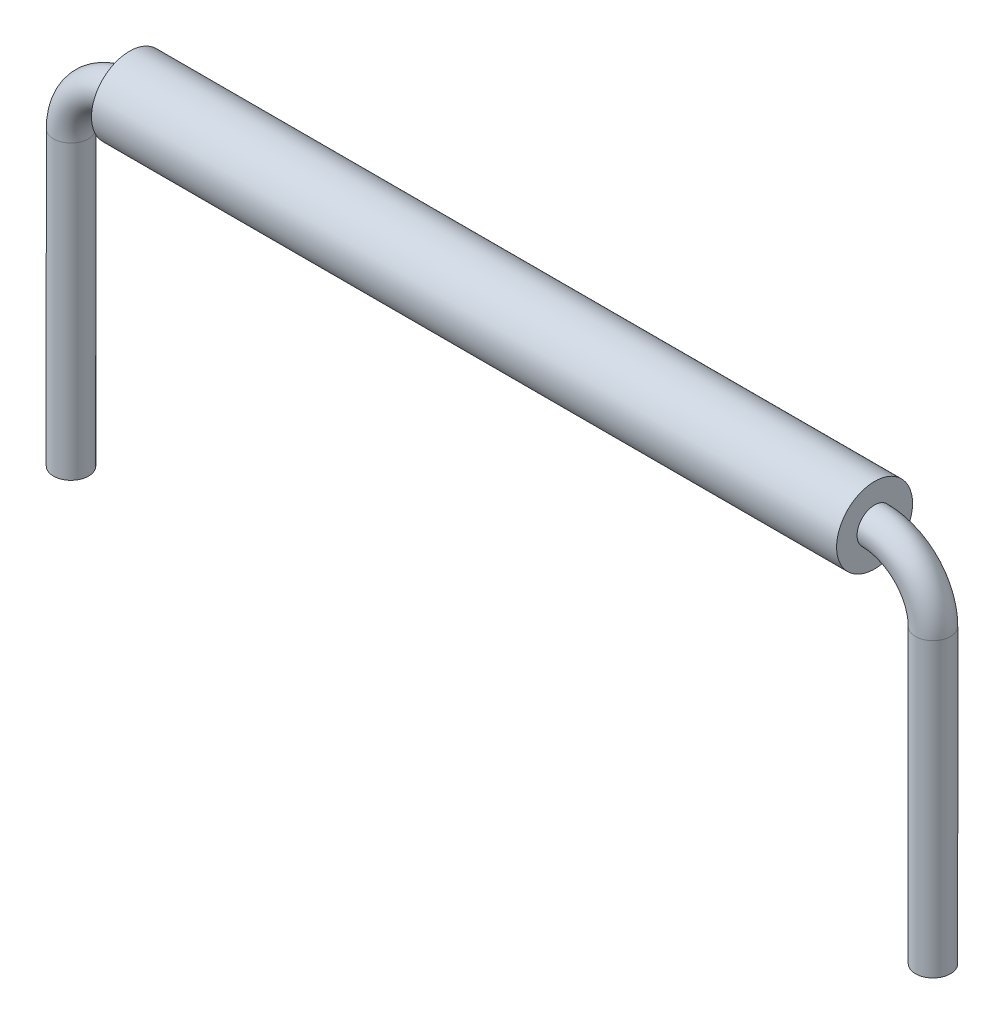
ISO-10303-21;
HEADER;
FILE_DESCRIPTION(('STEP AP214'),'2;1');
FILE_NAME('part.step','',(''),(''),'','','');
FILE_SCHEMA(('AUTOMOTIVE_DESIGN { 1 0 10303 214 1 1 1 1 }'));
ENDSEC;
DATA;
#1=APPLICATION_CONTEXT('core data for automotive mechanical design processes');
#2=APPLICATION_PROTOCOL_DEFINITION('international standard','automotive_design',2000,#1);
#3=PRODUCT_CONTEXT('',#1,'mechanical');
#4=PRODUCT('Part','Part','',(#3));
#5=PRODUCT_RELATED_PRODUCT_CATEGORY('part','',(#4));
#6=PRODUCT_DEFINITION_FORMATION('','',#4);
#7=PRODUCT_DEFINITION_CONTEXT('part definition',#1,'design');
#8=PRODUCT_DEFINITION('design','',#6,#7);
#9=PRODUCT_DEFINITION_SHAPE('','',#8);
#10=(LENGTH_UNIT() NAMED_UNIT(*) SI_UNIT(.MILLI.,.METRE.));
#11=(NAMED_UNIT(*) PLANE_ANGLE_UNIT() SI_UNIT($,.RADIAN.));
#12=(NAMED_UNIT(*) SI_UNIT($,.STERADIAN.) SOLID_ANGLE_UNIT());
#13=UNCERTAINTY_MEASURE_WITH_UNIT(LENGTH_MEASURE(1.E-05),#10,'distance_accuracy_value','');
#14=(GEOMETRIC_REPRESENTATION_CONTEXT(3) GLOBAL_UNCERTAINTY_ASSIGNED_CONTEXT((#13)) GLOBAL_UNIT_ASSIGNED_CONTEXT((#10,
#11,#12)) REPRESENTATION_CONTEXT('',''));
#15=CARTESIAN_POINT('',(0.,0.,0.));
#16=DIRECTION('',(0.,0.,1.));
#17=DIRECTION('',(1.,0.,0.));
#18=AXIS2_PLACEMENT_3D('',#15,#16,#17);
#19=CARTESIAN_POINT('',(6.3775,0.,0.));
#20=DIRECTION('',(1.,0.,0.));
#21=DIRECTION('',(0.,0.,-1.));
#22=AXIS2_PLACEMENT_3D('',#19,#20,#21);
#23=PLANE('',#22);
#24=CARTESIAN_POINT('',(6.3775,0.,0.));
#25=DIRECTION('',(1.,0.,0.));
#26=DIRECTION('',(0.,0.,-1.));
#27=AXIS2_PLACEMENT_3D('',#24,#25,#26);
#28=CIRCLE('',#27,0.65);
#29=CARTESIAN_POINT('',(6.3775,0.,-0.65));
#30=VERTEX_POINT('',#29);
#31=EDGE_CURVE('E11',#30,#30,#28,.T.);
#32=ORIENTED_EDGE('',*,*,#31,.T.);
#33=EDGE_LOOP('',(#32));
#34=FACE_BOUND('',#33,.T.);
#35=CARTESIAN_POINT('',(6.3775,0.,0.));
#36=DIRECTION('',(1.,0.,0.));
#37=DIRECTION('',(0.,0.,-1.));
#38=AXIS2_PLACEMENT_3D('',#35,#36,#37);
#39=CIRCLE('',#38,0.3);
#40=CARTESIAN_POINT('',(6.3775,0.,-0.3));
#41=VERTEX_POINT('',#40);
#42=EDGE_CURVE('E52',#41,#41,#39,.T.);
#43=ORIENTED_EDGE('',*,*,#42,.F.);
#44=EDGE_LOOP('',(#43));
#45=FACE_BOUND('',#44,.T.);
#46=ADVANCED_FACE('F45',(#34,#45),#23,.T.);
#47=CARTESIAN_POINT('',(6.3775,0.,0.));
#48=DIRECTION('',(-1.,0.,0.));
#49=DIRECTION('',(0.,0.,1.));
#50=AXIS2_PLACEMENT_3D('',#47,#48,#49);
#51=CYLINDRICAL_SURFACE('',#50,0.65);
#52=ORIENTED_EDGE('',*,*,#31,.F.);
#53=EDGE_LOOP('',(#52));
#54=FACE_BOUND('',#53,.T.);
#55=CARTESIAN_POINT('',(-6.3775,0.,0.));
#56=DIRECTION('',(1.,0.,0.));
#57=DIRECTION('',(0.,0.,-1.));
#58=AXIS2_PLACEMENT_3D('',#55,#56,#57);
#59=CIRCLE('',#58,0.65);
#60=CARTESIAN_POINT('',(-6.3775,0.,-0.65));
#61=VERTEX_POINT('',#60);
#62=EDGE_CURVE('E56',#61,#61,#59,.T.);
#63=ORIENTED_EDGE('',*,*,#62,.T.);
#64=EDGE_LOOP('',(#63));
#65=FACE_BOUND('',#64,.T.);
#66=ADVANCED_FACE('F47',(#54,#65),#51,.T.);
#67=CARTESIAN_POINT('',(6.3775,0.,0.));
#68=DIRECTION('',(-1.,0.,0.));
#69=DIRECTION('',(0.,0.,1.));
#70=AXIS2_PLACEMENT_3D('',#67,#68,#69);
#71=CYLINDRICAL_SURFACE('',#70,0.3);
#72=ORIENTED_EDGE('',*,*,#42,.T.);
#73=EDGE_LOOP('',(#72));
#74=FACE_BOUND('',#73,.T.);
#75=CARTESIAN_POINT('',(-6.3775,0.,0.));
#76=DIRECTION('',(1.,0.,0.));
#77=DIRECTION('',(0.,0.,-1.));
#78=AXIS2_PLACEMENT_3D('',#75,#76,#77);
#79=CIRCLE('',#78,0.3);
#80=CARTESIAN_POINT('',(-6.3775,0.,-0.3));
#81=VERTEX_POINT('',#80);
#82=EDGE_CURVE('E60',#81,#81,#79,.T.);
#83=ORIENTED_EDGE('',*,*,#82,.F.);
#84=EDGE_LOOP('',(#83));
#85=FACE_BOUND('',#84,.T.);
#86=ADVANCED_FACE('F69',(#74,#85),#71,.F.);
#87=CARTESIAN_POINT('',(-6.3775,0.,0.));
#88=DIRECTION('',(1.,0.,0.));
#89=DIRECTION('',(0.,0.,-1.));
#90=AXIS2_PLACEMENT_3D('',#87,#88,#89);
#91=PLANE('',#90);
#92=ORIENTED_EDGE('',*,*,#82,.T.);
#93=EDGE_LOOP('',(#92));
#94=FACE_BOUND('',#93,.T.);
#95=ORIENTED_EDGE('',*,*,#62,.F.);
#96=EDGE_LOOP('',(#95));
#97=FACE_BOUND('',#96,.T.);
#98=ADVANCED_FACE('F66',(#94,#97),#91,.F.);
#99=CLOSED_SHELL('',(#46,#66,#86,#98));
#100=MANIFOLD_SOLID_BREP('B2',#99);
#101=CARTESIAN_POINT('',(7.3775,-6.,0.));
#102=DIRECTION('',(0.,-1.,0.));
#103=DIRECTION('',(0.,0.,-1.));
#104=AXIS2_PLACEMENT_3D('',#101,#102,#103);
#105=PLANE('',#104);
#106=CARTESIAN_POINT('',(7.3775,-6.,0.));
#107=DIRECTION('',(0.,-1.,0.));
#108=DIRECTION('',(0.,0.,-1.));
#109=AXIS2_PLACEMENT_3D('',#106,#107,#108);
#110=CIRCLE('',#109,0.3);
#111=CARTESIAN_POINT('',(7.3775,-6.,-0.3));
#112=VERTEX_POINT('',#111);
#113=EDGE_CURVE('E129',#112,#112,#110,.T.);
#114=ORIENTED_EDGE('',*,*,#113,.T.);
#115=EDGE_LOOP('',(#114));
#116=FACE_BOUND('',#115,.T.);
#117=ADVANCED_FACE('F107',(#116),#105,.T.);
#118=CARTESIAN_POINT('',(-7.3775,-6.,0.));
#119=DIRECTION('',(0.,1.,0.));
#120=DIRECTION('',(0.,0.,-1.));
#121=AXIS2_PLACEMENT_3D('',#118,#119,#120);
#122=PLANE('',#121);
#123=CARTESIAN_POINT('',(-7.3775,-6.,0.));
#124=DIRECTION('',(0.,1.,0.));
#125=DIRECTION('',(0.,0.,-1.));
#126=AXIS2_PLACEMENT_3D('',#123,#124,#125);
#127=CIRCLE('',#126,0.3);
#128=CARTESIAN_POINT('',(-7.3775,-6.,-0.3));
#129=VERTEX_POINT('',#128);
#130=EDGE_CURVE('E44',#129,#129,#127,.T.);
#131=ORIENTED_EDGE('',*,*,#130,.F.);
#132=EDGE_LOOP('',(#131));
#133=FACE_BOUND('',#132,.T.);
#134=ADVANCED_FACE('F137',(#133),#122,.F.);
#135=CARTESIAN_POINT('',(7.3775,-6.,0.));
#136=DIRECTION('',(0.,1.,0.));
#137=DIRECTION('',(0.,0.,1.));
#138=AXIS2_PLACEMENT_3D('',#135,#136,#137);
#139=CYLINDRICAL_SURFACE('',#138,0.3);
#140=CARTESIAN_POINT('',(7.3775,-0.999999999999998,0.));
#141=DIRECTION('',(0.,-1.,0.));
#142=DIRECTION('',(0.,0.,-1.));
#143=AXIS2_PLACEMENT_3D('',#140,#141,#142);
#144=CIRCLE('',#143,0.3);
#145=CARTESIAN_POINT('',(7.6775,-0.999999999999998,0.));
#146=VERTEX_POINT('',#145);
#147=EDGE_CURVE('E126',#146,#146,#144,.T.);
#148=ORIENTED_EDGE('',*,*,#147,.T.);
#149=EDGE_LOOP('',(#148));
#150=FACE_BOUND('',#149,.T.);
#151=ORIENTED_EDGE('',*,*,#113,.F.);
#152=EDGE_LOOP('',(#151));
#153=FACE_BOUND('',#152,.T.);
#154=ADVANCED_FACE('F134',(#150,#153),#139,.T.);
#155=CARTESIAN_POINT('',(6.3775,-0.999999999999999,0.));
#156=DIRECTION('',(0.,0.,1.));
#157=DIRECTION('',(1.,0.,0.));
#158=AXIS2_PLACEMENT_3D('',#155,#156,#157);
#159=TOROIDAL_SURFACE('',#158,0.999999999999999,0.3);
#160=CARTESIAN_POINT('',(6.3775,0.,0.));
#161=DIRECTION('',(1.,0.,0.));
#162=DIRECTION('',(0.,0.,-1.));
#163=AXIS2_PLACEMENT_3D('',#160,#161,#162);
#164=CIRCLE('',#163,0.3);
#165=CARTESIAN_POINT('',(6.3775,0.300000000000001,0.));
#166=VERTEX_POINT('',#165);
#167=EDGE_CURVE('E121',#166,#166,#164,.T.);
#168=CARTESIAN_POINT('',(6.3775,-0.999999999999999,0.));
#169=DIRECTION('',(0.,0.,1.));
#170=DIRECTION('',(1.,0.,0.));
#171=AXIS2_PLACEMENT_3D('',#168,#169,#170);
#172=CIRCLE('',#171,1.3);
#173=EDGE_CURVE('',#146,#166,#172,.T.);
#174=ORIENTED_EDGE('',*,*,#147,.F.);
#175=ORIENTED_EDGE('',*,*,#167,.T.);
#176=ORIENTED_EDGE('',*,*,#173,.T.);
#177=ORIENTED_EDGE('',*,*,#173,.F.);
#178=EDGE_LOOP('',(#174,#176,#175,#177));
#179=FACE_BOUND('',#178,.T.);
#180=ADVANCED_FACE('F136',(#179),#159,.T.);
#181=CARTESIAN_POINT('',(6.3775,0.,0.));
#182=DIRECTION('',(-1.,0.,0.));
#183=DIRECTION('',(0.,-1.,0.));
#184=AXIS2_PLACEMENT_3D('',#181,#182,#183);
#185=CYLINDRICAL_SURFACE('',#184,0.3);
#186=CARTESIAN_POINT('',(-6.3775,0.,0.));
#187=DIRECTION('',(1.,0.,0.));
#188=DIRECTION('',(0.,0.,-1.));
#189=AXIS2_PLACEMENT_3D('',#186,#187,#188);
#190=CIRCLE('',#189,0.3);
#191=CARTESIAN_POINT('',(-6.3775,0.299999999999999,0.));
#192=VERTEX_POINT('',#191);
#193=EDGE_CURVE('E117',#192,#192,#190,.T.);
#194=ORIENTED_EDGE('',*,*,#193,.T.);
#195=EDGE_LOOP('',(#194));
#196=FACE_BOUND('',#195,.T.);
#197=ORIENTED_EDGE('',*,*,#167,.F.);
#198=EDGE_LOOP('',(#197));
#199=FACE_BOUND('',#198,.T.);
#200=ADVANCED_FACE('F144',(#196,#199),#185,.T.);
#201=CARTESIAN_POINT('',(-6.3775,-1.,0.));
#202=DIRECTION('',(0.,0.,1.));
#203=DIRECTION('',(1.,0.,0.));
#204=AXIS2_PLACEMENT_3D('',#201,#202,#203);
#205=TOROIDAL_SURFACE('',#204,1.,0.3);
#206=CARTESIAN_POINT('',(-7.3775,-1.,0.));
#207=DIRECTION('',(0.,1.,0.));
#208=DIRECTION('',(0.,0.,-1.));
#209=AXIS2_PLACEMENT_3D('',#206,#207,#208);
#210=CIRCLE('',#209,0.3);
#211=CARTESIAN_POINT('',(-7.6775,-1.,0.));
#212=VERTEX_POINT('',#211);
#213=EDGE_CURVE('E113',#212,#212,#210,.T.);
#214=CARTESIAN_POINT('',(-6.3775,-1.,0.));
#215=DIRECTION('',(0.,0.,1.));
#216=DIRECTION('',(1.,0.,0.));
#217=AXIS2_PLACEMENT_3D('',#214,#215,#216);
#218=CIRCLE('',#217,1.3);
#219=EDGE_CURVE('',#192,#212,#218,.T.);
#220=ORIENTED_EDGE('',*,*,#193,.F.);
#221=ORIENTED_EDGE('',*,*,#213,.T.);
#222=ORIENTED_EDGE('',*,*,#219,.T.);
#223=ORIENTED_EDGE('',*,*,#219,.F.);
#224=EDGE_LOOP('',(#220,#222,#221,#223));
#225=FACE_BOUND('',#224,.T.);
#226=ADVANCED_FACE('F150',(#225),#205,.T.);
#227=CARTESIAN_POINT('',(-7.3775,-1.,0.));
#228=DIRECTION('',(0.,-1.,0.));
#229=DIRECTION('',(1.,0.,0.));
#230=AXIS2_PLACEMENT_3D('',#227,#228,#229);
#231=CYLINDRICAL_SURFACE('',#230,0.3);
#232=ORIENTED_EDGE('',*,*,#130,.T.);
#233=EDGE_LOOP('',(#232));
#234=FACE_BOUND('',#233,.T.);
#235=ORIENTED_EDGE('',*,*,#213,.F.);
#236=EDGE_LOOP('',(#235));
#237=FACE_BOUND('',#236,.T.);
#238=ADVANCED_FACE('F148',(#234,#237),#231,.T.);
#239=CLOSED_SHELL('',(#117,#134,#154,#180,#200,#226,#238));
#240=MANIFOLD_SOLID_BREP('B6',#239);
#241=ADVANCED_BREP_SHAPE_REPRESENTATION('',(#18,#100,#240),#14);
#242=SHAPE_DEFINITION_REPRESENTATION(#9,#241);
ENDSEC;
END-ISO-10303-21;
